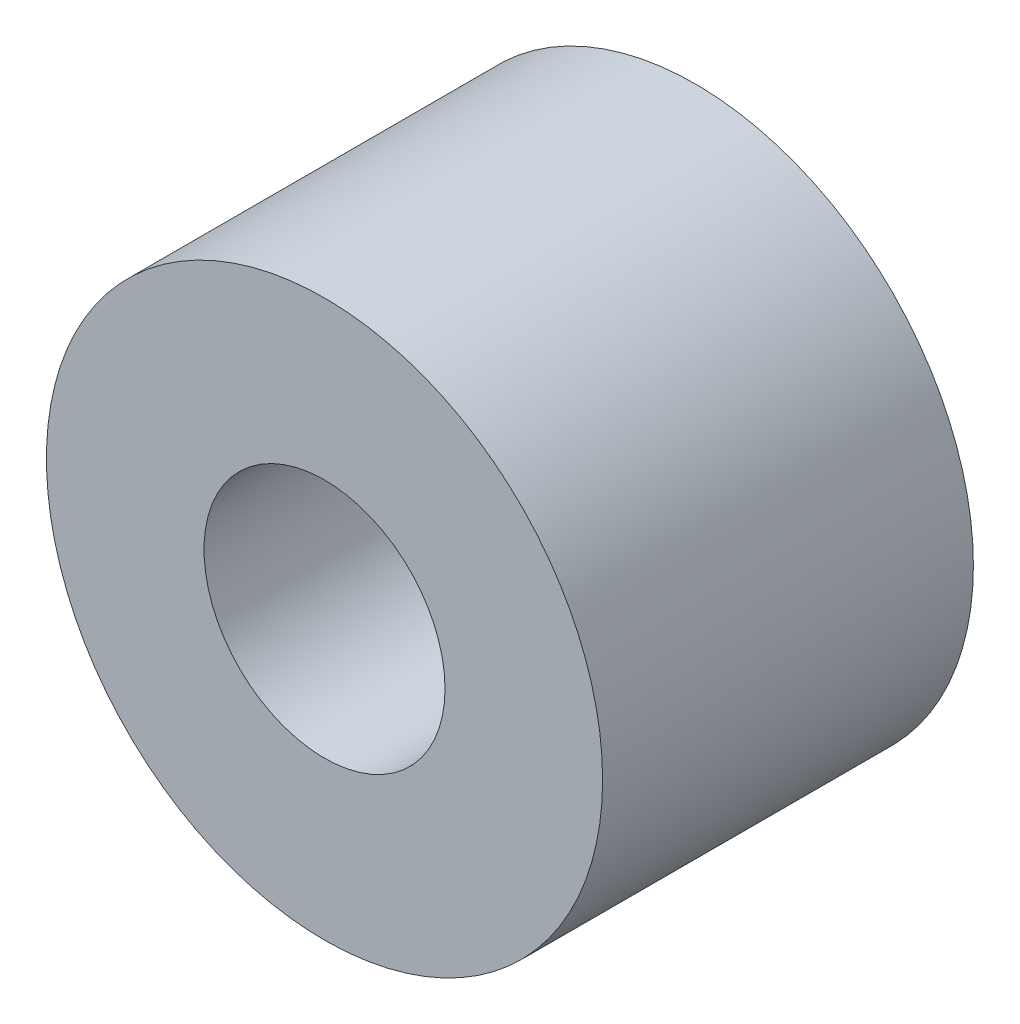
ISO-10303-21;
HEADER;
FILE_DESCRIPTION(('STEP AP214'),'2;1');
FILE_NAME('part.step','',(''),(''),'','','');
FILE_SCHEMA(('AUTOMOTIVE_DESIGN { 1 0 10303 214 1 1 1 1 }'));
ENDSEC;
DATA;
#1=APPLICATION_CONTEXT('core data for automotive mechanical design processes');
#2=APPLICATION_PROTOCOL_DEFINITION('international standard','automotive_design',2000,#1);
#3=PRODUCT_CONTEXT('',#1,'mechanical');
#4=PRODUCT('Part','Part','',(#3));
#5=PRODUCT_RELATED_PRODUCT_CATEGORY('part','',(#4));
#6=PRODUCT_DEFINITION_FORMATION('','',#4);
#7=PRODUCT_DEFINITION_CONTEXT('part definition',#1,'design');
#8=PRODUCT_DEFINITION('design','',#6,#7);
#9=PRODUCT_DEFINITION_SHAPE('','',#8);
#10=(LENGTH_UNIT() NAMED_UNIT(*) SI_UNIT(.MILLI.,.METRE.));
#11=(NAMED_UNIT(*) PLANE_ANGLE_UNIT() SI_UNIT($,.RADIAN.));
#12=(NAMED_UNIT(*) SI_UNIT($,.STERADIAN.) SOLID_ANGLE_UNIT());
#13=UNCERTAINTY_MEASURE_WITH_UNIT(LENGTH_MEASURE(1.E-05),#10,'distance_accuracy_value','');
#14=(GEOMETRIC_REPRESENTATION_CONTEXT(3) GLOBAL_UNCERTAINTY_ASSIGNED_CONTEXT((#13)) GLOBAL_UNIT_ASSIGNED_CONTEXT((#10,
#11,#12)) REPRESENTATION_CONTEXT('',''));
#15=CARTESIAN_POINT('',(0.,0.,0.));
#16=DIRECTION('',(0.,0.,1.));
#17=DIRECTION('',(1.,0.,0.));
#18=AXIS2_PLACEMENT_3D('',#15,#16,#17);
#19=CARTESIAN_POINT('',(0.,0.,-6.35));
#20=DIRECTION('',(0.,0.,1.));
#21=DIRECTION('',(1.,0.,0.));
#22=AXIS2_PLACEMENT_3D('',#19,#20,#21);
#23=CYLINDRICAL_SURFACE('',#22,9.525);
#24=CARTESIAN_POINT('',(0.,0.,-6.35));
#25=DIRECTION('',(0.,0.,1.));
#26=DIRECTION('',(1.,0.,0.));
#27=AXIS2_PLACEMENT_3D('',#24,#25,#26);
#28=CIRCLE('',#27,9.525);
#29=CARTESIAN_POINT('',(9.525,0.,-6.35));
#30=VERTEX_POINT('',#29);
#31=EDGE_CURVE('E10',#30,#30,#28,.T.);
#32=ORIENTED_EDGE('',*,*,#31,.T.);
#33=EDGE_LOOP('',(#32));
#34=FACE_BOUND('',#33,.T.);
#35=CARTESIAN_POINT('',(0.,0.,6.35));
#36=DIRECTION('',(0.,0.,1.));
#37=DIRECTION('',(1.,0.,0.));
#38=AXIS2_PLACEMENT_3D('',#35,#36,#37);
#39=CIRCLE('',#38,9.525);
#40=CARTESIAN_POINT('',(9.525,0.,6.35));
#41=VERTEX_POINT('',#40);
#42=EDGE_CURVE('E53',#41,#41,#39,.T.);
#43=ORIENTED_EDGE('',*,*,#42,.F.);
#44=EDGE_LOOP('',(#43));
#45=FACE_BOUND('',#44,.T.);
#46=ADVANCED_FACE('F41',(#34,#45),#23,.T.);
#47=CARTESIAN_POINT('',(0.,0.,-6.35));
#48=DIRECTION('',(0.,0.,1.));
#49=DIRECTION('',(1.,0.,0.));
#50=AXIS2_PLACEMENT_3D('',#47,#48,#49);
#51=PLANE('',#50);
#52=CARTESIAN_POINT('',(0.,0.,-6.35));
#53=DIRECTION('',(0.,0.,1.));
#54=DIRECTION('',(1.,0.,0.));
#55=AXIS2_PLACEMENT_3D('',#52,#53,#54);
#56=CIRCLE('',#55,4.1275);
#57=CARTESIAN_POINT('',(4.1275,0.,-6.35));
#58=VERTEX_POINT('',#57);
#59=EDGE_CURVE('E48',#58,#58,#56,.T.);
#60=ORIENTED_EDGE('',*,*,#59,.T.);
#61=EDGE_LOOP('',(#60));
#62=FACE_BOUND('',#61,.T.);
#63=ORIENTED_EDGE('',*,*,#31,.F.);
#64=EDGE_LOOP('',(#63));
#65=FACE_BOUND('',#64,.T.);
#66=ADVANCED_FACE('F74',(#62,#65),#51,.F.);
#67=CARTESIAN_POINT('',(0.,0.,-6.35));
#68=DIRECTION('',(0.,0.,1.));
#69=DIRECTION('',(1.,0.,0.));
#70=AXIS2_PLACEMENT_3D('',#67,#68,#69);
#71=CYLINDRICAL_SURFACE('',#70,4.1275);
#72=ORIENTED_EDGE('',*,*,#59,.F.);
#73=EDGE_LOOP('',(#72));
#74=FACE_BOUND('',#73,.T.);
#75=CARTESIAN_POINT('',(0.,0.,6.35));
#76=DIRECTION('',(0.,0.,1.));
#77=DIRECTION('',(1.,0.,0.));
#78=AXIS2_PLACEMENT_3D('',#75,#76,#77);
#79=CIRCLE('',#78,4.1275);
#80=CARTESIAN_POINT('',(4.1275,0.,6.35));
#81=VERTEX_POINT('',#80);
#82=EDGE_CURVE('E58',#81,#81,#79,.T.);
#83=ORIENTED_EDGE('',*,*,#82,.T.);
#84=EDGE_LOOP('',(#83));
#85=FACE_BOUND('',#84,.T.);
#86=ADVANCED_FACE('F65',(#74,#85),#71,.F.);
#87=CARTESIAN_POINT('',(0.,0.,6.35));
#88=DIRECTION('',(0.,0.,1.));
#89=DIRECTION('',(1.,0.,0.));
#90=AXIS2_PLACEMENT_3D('',#87,#88,#89);
#91=PLANE('',#90);
#92=ORIENTED_EDGE('',*,*,#42,.T.);
#93=EDGE_LOOP('',(#92));
#94=FACE_BOUND('',#93,.T.);
#95=ORIENTED_EDGE('',*,*,#82,.F.);
#96=EDGE_LOOP('',(#95));
#97=FACE_BOUND('',#96,.T.);
#98=ADVANCED_FACE('F67',(#94,#97),#91,.T.);
#99=CLOSED_SHELL('',(#46,#66,#86,#98));
#100=MANIFOLD_SOLID_BREP('B2',#99);
#101=ADVANCED_BREP_SHAPE_REPRESENTATION('',(#18,#100),#14);
#102=SHAPE_DEFINITION_REPRESENTATION(#9,#101);
ENDSEC;
END-ISO-10303-21;
